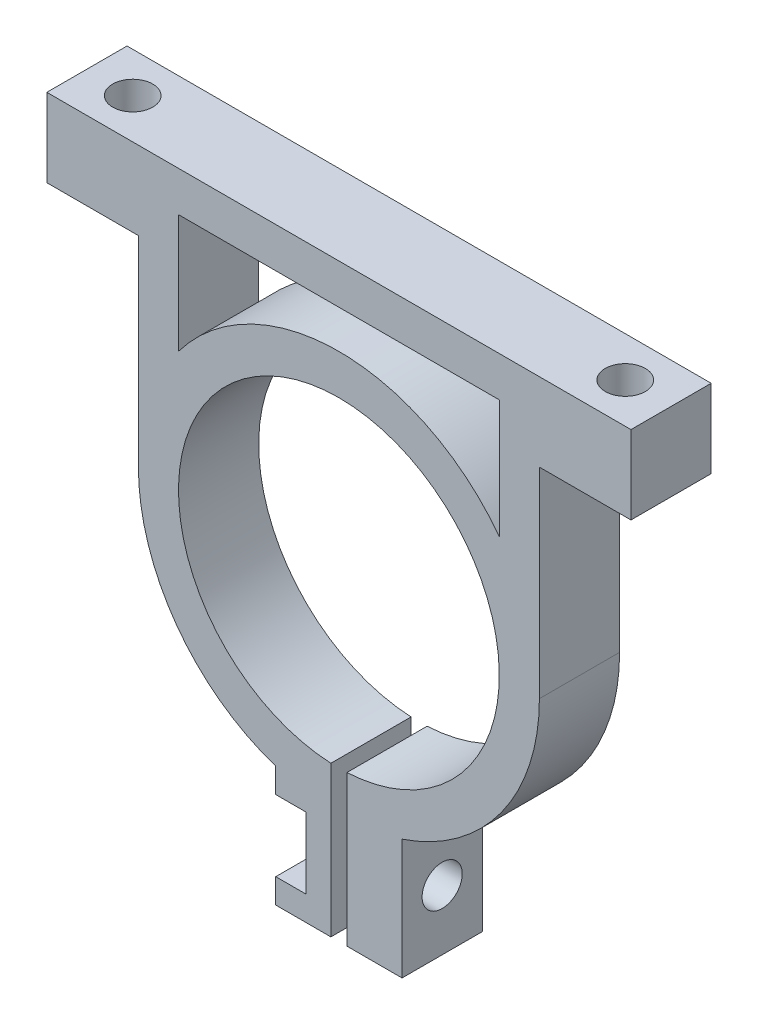
ISO-10303-21;
HEADER;
FILE_DESCRIPTION(('STEP AP214'),'2;1');
FILE_NAME('part.step','',(''),(''),'','','');
FILE_SCHEMA(('AUTOMOTIVE_DESIGN { 1 0 10303 214 1 1 1 1 }'));
ENDSEC;
DATA;
#1=APPLICATION_CONTEXT('core data for automotive mechanical design processes');
#2=APPLICATION_PROTOCOL_DEFINITION('international standard','automotive_design',2000,#1);
#3=PRODUCT_CONTEXT('',#1,'mechanical');
#4=PRODUCT('Part','Part','',(#3));
#5=PRODUCT_RELATED_PRODUCT_CATEGORY('part','',(#4));
#6=PRODUCT_DEFINITION_FORMATION('','',#4);
#7=PRODUCT_DEFINITION_CONTEXT('part definition',#1,'design');
#8=PRODUCT_DEFINITION('design','',#6,#7);
#9=PRODUCT_DEFINITION_SHAPE('','',#8);
#10=(LENGTH_UNIT() NAMED_UNIT(*) SI_UNIT(.MILLI.,.METRE.));
#11=(NAMED_UNIT(*) PLANE_ANGLE_UNIT() SI_UNIT($,.RADIAN.));
#12=(NAMED_UNIT(*) SI_UNIT($,.STERADIAN.) SOLID_ANGLE_UNIT());
#13=UNCERTAINTY_MEASURE_WITH_UNIT(LENGTH_MEASURE(1.E-05),#10,'distance_accuracy_value','');
#14=(GEOMETRIC_REPRESENTATION_CONTEXT(3) GLOBAL_UNCERTAINTY_ASSIGNED_CONTEXT((#13)) GLOBAL_UNIT_ASSIGNED_CONTEXT((#10,
#11,#12)) REPRESENTATION_CONTEXT('',''));
#15=CARTESIAN_POINT('',(0.,0.,0.));
#16=DIRECTION('',(0.,0.,1.));
#17=DIRECTION('',(1.,0.,0.));
#18=AXIS2_PLACEMENT_3D('',#15,#16,#17);
#19=CARTESIAN_POINT('',(-5.,-15.0670376982339,6.35));
#20=DIRECTION('',(1.,0.,0.));
#21=DIRECTION('',(0.,1.,0.));
#22=AXIS2_PLACEMENT_3D('',#19,#20,#21);
#23=PLANE('',#22);
#24=DIRECTION('',(0.,-1.,0.));
#25=VECTOR('',#24,1.);
#26=CARTESIAN_POINT('',(-5.,-15.0670376982339,6.35));
#27=LINE('',#26,#25);
#28=CARTESIAN_POINT('',(-5.,-22.6430376982338,6.35));
#29=VERTEX_POINT('',#28);
#30=CARTESIAN_POINT('',(-5.,-24.5920376982338,6.35));
#31=VERTEX_POINT('',#30);
#32=EDGE_CURVE('E300',#29,#31,#27,.T.);
#33=ORIENTED_EDGE('',*,*,#32,.F.);
#34=DIRECTION('',(0.,0.,-1.));
#35=VECTOR('',#34,1.);
#36=CARTESIAN_POINT('',(-5.,-22.6430376982338,6.35));
#37=LINE('',#36,#35);
#38=CARTESIAN_POINT('',(-5.,-22.6430376982338,0.));
#39=VERTEX_POINT('',#38);
#40=EDGE_CURVE('E11',#29,#39,#37,.T.);
#41=ORIENTED_EDGE('',*,*,#40,.T.);
#42=DIRECTION('',(0.,-1.,0.));
#43=VECTOR('',#42,1.);
#44=CARTESIAN_POINT('',(-5.,-15.0670376982339,0.));
#45=LINE('',#44,#43);
#46=CARTESIAN_POINT('',(-5.,-24.5920376982338,0.));
#47=VERTEX_POINT('',#46);
#48=EDGE_CURVE('E329',#39,#47,#45,.T.);
#49=ORIENTED_EDGE('',*,*,#48,.T.);
#50=DIRECTION('',(0.,0.,-1.));
#51=VECTOR('',#50,1.);
#52=CARTESIAN_POINT('',(-5.,-24.5920376982338,6.35));
#53=LINE('',#52,#51);
#54=EDGE_CURVE('E358',#31,#47,#53,.T.);
#55=ORIENTED_EDGE('',*,*,#54,.F.);
#56=EDGE_LOOP('',(#33,#41,#49,#55));
#57=FACE_BOUND('',#56,.T.);
#58=ADVANCED_FACE('F33',(#57),#23,.F.);
#59=CARTESIAN_POINT('',(-5.,-24.5920376982338,6.35));
#60=DIRECTION('',(0.,1.,0.));
#61=DIRECTION('',(0.,0.,1.));
#62=AXIS2_PLACEMENT_3D('',#59,#60,#61);
#63=PLANE('',#62);
#64=DIRECTION('',(1.,0.,0.));
#65=VECTOR('',#64,1.);
#66=CARTESIAN_POINT('',(-5.,-24.5920376982338,6.35));
#67=LINE('',#66,#65);
#68=CARTESIAN_POINT('',(0.635,-24.5920376982338,6.35));
#69=VERTEX_POINT('',#68);
#70=CARTESIAN_POINT('',(5.,-24.5920376982338,6.35));
#71=VERTEX_POINT('',#70);
#72=EDGE_CURVE('E304',#69,#71,#67,.T.);
#73=ORIENTED_EDGE('',*,*,#72,.F.);
#74=DIRECTION('',(0.,0.,-1.));
#75=VECTOR('',#74,1.);
#76=CARTESIAN_POINT('',(0.635,-24.5920376982338,6.35));
#77=LINE('',#76,#75);
#78=CARTESIAN_POINT('',(0.635,-24.5920376982338,0.));
#79=VERTEX_POINT('',#78);
#80=EDGE_CURVE('E276',#69,#79,#77,.T.);
#81=ORIENTED_EDGE('',*,*,#80,.T.);
#82=DIRECTION('',(1.,0.,0.));
#83=VECTOR('',#82,1.);
#84=CARTESIAN_POINT('',(-5.,-24.5920376982338,0.));
#85=LINE('',#84,#83);
#86=CARTESIAN_POINT('',(5.,-24.5920376982338,0.));
#87=VERTEX_POINT('',#86);
#88=EDGE_CURVE('E333',#79,#87,#85,.T.);
#89=ORIENTED_EDGE('',*,*,#88,.T.);
#90=DIRECTION('',(0.,0.,-1.));
#91=VECTOR('',#90,1.);
#92=CARTESIAN_POINT('',(5.,-24.5920376982338,6.35));
#93=LINE('',#92,#91);
#94=EDGE_CURVE('E355',#71,#87,#93,.T.);
#95=ORIENTED_EDGE('',*,*,#94,.F.);
#96=EDGE_LOOP('',(#73,#81,#89,#95));
#97=FACE_BOUND('',#96,.T.);
#98=ADVANCED_FACE('F440',(#97),#63,.F.);
#99=CARTESIAN_POINT('',(0.,0.,6.35));
#100=DIRECTION('',(0.,0.,1.));
#101=DIRECTION('',(1.,0.,0.));
#102=AXIS2_PLACEMENT_3D('',#99,#100,#101);
#103=PLANE('',#102);
#104=CARTESIAN_POINT('',(0.,0.,6.35));
#105=DIRECTION('',(0.,0.,-1.));
#106=DIRECTION('',(1.,0.,0.));
#107=AXIS2_PLACEMENT_3D('',#104,#105,#106);
#108=CIRCLE('',#107,15.875);
#109=CARTESIAN_POINT('',(-12.7,9.525,6.35));
#110=VERTEX_POINT('',#109);
#111=CARTESIAN_POINT('',(12.7,9.525,6.35));
#112=VERTEX_POINT('',#111);
#113=EDGE_CURVE('E48',#110,#112,#108,.T.);
#114=ORIENTED_EDGE('',*,*,#113,.F.);
#115=DIRECTION('',(0.,-1.,0.));
#116=VECTOR('',#115,1.);
#117=CARTESIAN_POINT('',(-12.7,18.9,6.35));
#118=LINE('',#117,#116);
#119=CARTESIAN_POINT('',(-12.7,18.9,6.35));
#120=VERTEX_POINT('',#119);
#121=EDGE_CURVE('E213',#120,#110,#118,.T.);
#122=ORIENTED_EDGE('',*,*,#121,.F.);
#123=DIRECTION('',(-1.,0.,0.));
#124=VECTOR('',#123,1.);
#125=CARTESIAN_POINT('',(12.7,18.9,6.35));
#126=LINE('',#125,#124);
#127=CARTESIAN_POINT('',(12.7,18.9,6.35));
#128=VERTEX_POINT('',#127);
#129=EDGE_CURVE('E197',#128,#120,#126,.T.);
#130=ORIENTED_EDGE('',*,*,#129,.F.);
#131=DIRECTION('',(0.,1.,0.));
#132=VECTOR('',#131,1.);
#133=CARTESIAN_POINT('',(12.7,9.525,6.35));
#134=LINE('',#133,#132);
#135=EDGE_CURVE('E206',#112,#128,#134,.T.);
#136=ORIENTED_EDGE('',*,*,#135,.F.);
#137=EDGE_LOOP('',(#114,#122,#130,#136));
#138=FACE_BOUND('',#137,.T.);
#139=DIRECTION('',(1.,0.,0.));
#140=VECTOR('',#139,1.);
#141=CARTESIAN_POINT('',(-7.4,-22.6430376982338,6.35));
#142=LINE('',#141,#140);
#143=CARTESIAN_POINT('',(-2.6,-22.6430376982338,6.35));
#144=VERTEX_POINT('',#143);
#145=EDGE_CURVE('E248',#29,#144,#142,.T.);
#146=ORIENTED_EDGE('',*,*,#145,.F.);
#147=ORIENTED_EDGE('',*,*,#32,.T.);
#148=CARTESIAN_POINT('',(-0.635,-24.5920376982338,6.35));
#149=VERTEX_POINT('',#148);
#150=EDGE_CURVE('E305',#31,#149,#67,.T.);
#151=ORIENTED_EDGE('',*,*,#150,.T.);
#152=DIRECTION('',(0.,-1.,0.));
#153=VECTOR('',#152,1.);
#154=CARTESIAN_POINT('',(-0.635,-26.10231,6.35));
#155=LINE('',#154,#153);
#156=CARTESIAN_POINT('',(-0.635,-12.6841150657032,6.35));
#157=VERTEX_POINT('',#156);
#158=EDGE_CURVE('E268',#157,#149,#155,.T.);
#159=ORIENTED_EDGE('',*,*,#158,.F.);
#160=CARTESIAN_POINT('',(0.,0.,6.35));
#161=DIRECTION('',(0.,0.,1.));
#162=DIRECTION('',(1.,0.,0.));
#163=AXIS2_PLACEMENT_3D('',#160,#161,#162);
#164=CIRCLE('',#163,12.7);
#165=CARTESIAN_POINT('',(0.635,-12.6841150657032,6.35));
#166=VERTEX_POINT('',#165);
#167=EDGE_CURVE('E280',#166,#157,#164,.T.);
#168=ORIENTED_EDGE('',*,*,#167,.F.);
#169=DIRECTION('',(0.,1.,0.));
#170=VECTOR('',#169,1.);
#171=CARTESIAN_POINT('',(0.635,-26.10231,6.35));
#172=LINE('',#171,#170);
#173=EDGE_CURVE('E263',#69,#166,#172,.T.);
#174=ORIENTED_EDGE('',*,*,#173,.F.);
#175=ORIENTED_EDGE('',*,*,#72,.T.);
#176=DIRECTION('',(0.,1.,0.));
#177=VECTOR('',#176,1.);
#178=CARTESIAN_POINT('',(5.,-15.0670376982339,6.35));
#179=LINE('',#178,#177);
#180=CARTESIAN_POINT('',(5.,-15.0670376982339,6.35));
#181=VERTEX_POINT('',#180);
#182=EDGE_CURVE('E308',#71,#181,#179,.T.);
#183=ORIENTED_EDGE('',*,*,#182,.T.);
#184=CARTESIAN_POINT('',(0.,0.,6.35));
#185=DIRECTION('',(0.,0.,1.));
#186=DIRECTION('',(1.,0.,0.));
#187=AXIS2_PLACEMENT_3D('',#184,#185,#186);
#188=CIRCLE('',#187,15.875);
#189=CARTESIAN_POINT('',(15.875,0.,6.35));
#190=VERTEX_POINT('',#189);
#191=EDGE_CURVE('E310',#181,#190,#188,.T.);
#192=ORIENTED_EDGE('',*,*,#191,.T.);
#193=DIRECTION('',(0.,1.,0.));
#194=VECTOR('',#193,1.);
#195=CARTESIAN_POINT('',(15.875,0.,6.35));
#196=LINE('',#195,#194);
#197=CARTESIAN_POINT('',(15.875,15.875,6.35));
#198=VERTEX_POINT('',#197);
#199=EDGE_CURVE('E312',#190,#198,#196,.T.);
#200=ORIENTED_EDGE('',*,*,#199,.T.);
#201=DIRECTION('',(1.,0.,0.));
#202=VECTOR('',#201,1.);
#203=CARTESIAN_POINT('',(15.875,15.875,6.35));
#204=LINE('',#203,#202);
#205=CARTESIAN_POINT('',(23.124999989,15.875,6.35));
#206=VERTEX_POINT('',#205);
#207=EDGE_CURVE('E314',#198,#206,#204,.T.);
#208=ORIENTED_EDGE('',*,*,#207,.T.);
#209=DIRECTION('',(0.,1.,0.));
#210=VECTOR('',#209,1.);
#211=CARTESIAN_POINT('',(23.124999989,15.875,6.35));
#212=LINE('',#211,#210);
#213=CARTESIAN_POINT('',(23.124999989,22.075,6.35));
#214=VERTEX_POINT('',#213);
#215=EDGE_CURVE('E286',#206,#214,#212,.T.);
#216=ORIENTED_EDGE('',*,*,#215,.T.);
#217=DIRECTION('',(-1.,0.,0.));
#218=VECTOR('',#217,1.);
#219=CARTESIAN_POINT('',(-23.124999989,22.075,6.35));
#220=LINE('',#219,#218);
#221=CARTESIAN_POINT('',(-23.124999989,22.075,6.35));
#222=VERTEX_POINT('',#221);
#223=EDGE_CURVE('E289',#214,#222,#220,.T.);
#224=ORIENTED_EDGE('',*,*,#223,.T.);
#225=DIRECTION('',(0.,-1.,0.));
#226=VECTOR('',#225,1.);
#227=CARTESIAN_POINT('',(-23.124999989,15.875,6.35));
#228=LINE('',#227,#226);
#229=CARTESIAN_POINT('',(-23.124999989,15.875,6.35));
#230=VERTEX_POINT('',#229);
#231=EDGE_CURVE('E292',#222,#230,#228,.T.);
#232=ORIENTED_EDGE('',*,*,#231,.T.);
#233=DIRECTION('',(1.,0.,0.));
#234=VECTOR('',#233,1.);
#235=CARTESIAN_POINT('',(-23.124999989,15.875,6.35));
#236=LINE('',#235,#234);
#237=CARTESIAN_POINT('',(-15.875,15.875,6.35));
#238=VERTEX_POINT('',#237);
#239=EDGE_CURVE('E294',#230,#238,#236,.T.);
#240=ORIENTED_EDGE('',*,*,#239,.T.);
#241=DIRECTION('',(0.,-1.,0.));
#242=VECTOR('',#241,1.);
#243=CARTESIAN_POINT('',(-15.875,0.,6.35));
#244=LINE('',#243,#242);
#245=CARTESIAN_POINT('',(-15.875,0.,6.35));
#246=VERTEX_POINT('',#245);
#247=EDGE_CURVE('E296',#238,#246,#244,.T.);
#248=ORIENTED_EDGE('',*,*,#247,.T.);
#249=CARTESIAN_POINT('',(0.,0.,6.35));
#250=DIRECTION('',(0.,0.,1.));
#251=DIRECTION('',(1.,0.,0.));
#252=AXIS2_PLACEMENT_3D('',#249,#250,#251);
#253=CIRCLE('',#252,15.875);
#254=CARTESIAN_POINT('',(-5.,-15.0670376982338,6.35));
#255=VERTEX_POINT('',#254);
#256=EDGE_CURVE('E298',#246,#255,#253,.T.);
#257=ORIENTED_EDGE('',*,*,#256,.T.);
#258=CARTESIAN_POINT('',(-5.,-17.0160376982338,6.35));
#259=VERTEX_POINT('',#258);
#260=EDGE_CURVE('E301',#255,#259,#27,.T.);
#261=ORIENTED_EDGE('',*,*,#260,.T.);
#262=DIRECTION('',(-1.,0.,0.));
#263=VECTOR('',#262,1.);
#264=CARTESIAN_POINT('',(-7.4,-17.0160376982338,6.35));
#265=LINE('',#264,#263);
#266=CARTESIAN_POINT('',(-2.6,-17.0160376982338,6.35));
#267=VERTEX_POINT('',#266);
#268=EDGE_CURVE('E246',#267,#259,#265,.T.);
#269=ORIENTED_EDGE('',*,*,#268,.F.);
#270=DIRECTION('',(0.,1.,0.));
#271=VECTOR('',#270,1.);
#272=CARTESIAN_POINT('',(-2.6,-22.6430376982338,6.35));
#273=LINE('',#272,#271);
#274=EDGE_CURVE('E237',#144,#267,#273,.T.);
#275=ORIENTED_EDGE('',*,*,#274,.F.);
#276=EDGE_LOOP('',(#146,#147,#151,#159,#168,#174,#175,#183,#192,#200,#208,#216,#224,#232,#240,
#248,#257,#261,#269,#275));
#277=FACE_BOUND('',#276,.T.);
#278=ADVANCED_FACE('F210',(#138,#277),#103,.T.);
#279=CARTESIAN_POINT('',(0.,0.,0.));
#280=DIRECTION('',(0.,0.,1.));
#281=DIRECTION('',(1.,0.,0.));
#282=AXIS2_PLACEMENT_3D('',#279,#280,#281);
#283=PLANE('',#282);
#284=DIRECTION('',(0.,1.,0.));
#285=VECTOR('',#284,1.);
#286=CARTESIAN_POINT('',(-12.7,18.9,0.));
#287=LINE('',#286,#285);
#288=CARTESIAN_POINT('',(-12.7,9.525,0.));
#289=VERTEX_POINT('',#288);
#290=CARTESIAN_POINT('',(-12.7,18.9,0.));
#291=VERTEX_POINT('',#290);
#292=EDGE_CURVE('E558',#289,#291,#287,.T.);
#293=ORIENTED_EDGE('',*,*,#292,.F.);
#294=CARTESIAN_POINT('',(0.,0.,0.));
#295=DIRECTION('',(0.,0.,1.));
#296=DIRECTION('',(1.,0.,0.));
#297=AXIS2_PLACEMENT_3D('',#294,#295,#296);
#298=CIRCLE('',#297,15.875);
#299=CARTESIAN_POINT('',(12.7,9.525,0.));
#300=VERTEX_POINT('',#299);
#301=EDGE_CURVE('E225',#300,#289,#298,.T.);
#302=ORIENTED_EDGE('',*,*,#301,.F.);
#303=DIRECTION('',(0.,-1.,0.));
#304=VECTOR('',#303,1.);
#305=CARTESIAN_POINT('',(12.7,9.525,0.));
#306=LINE('',#305,#304);
#307=CARTESIAN_POINT('',(12.7,18.9,0.));
#308=VERTEX_POINT('',#307);
#309=EDGE_CURVE('E222',#308,#300,#306,.T.);
#310=ORIENTED_EDGE('',*,*,#309,.F.);
#311=DIRECTION('',(1.,0.,0.));
#312=VECTOR('',#311,1.);
#313=CARTESIAN_POINT('',(12.7,18.9,0.));
#314=LINE('',#313,#312);
#315=EDGE_CURVE('E200',#291,#308,#314,.T.);
#316=ORIENTED_EDGE('',*,*,#315,.F.);
#317=EDGE_LOOP('',(#293,#302,#310,#316));
#318=FACE_BOUND('',#317,.T.);
#319=ORIENTED_EDGE('',*,*,#48,.F.);
#320=DIRECTION('',(-1.,0.,0.));
#321=VECTOR('',#320,1.);
#322=CARTESIAN_POINT('',(-7.4,-22.6430376982338,0.));
#323=LINE('',#322,#321);
#324=CARTESIAN_POINT('',(-2.6,-22.6430376982338,0.));
#325=VERTEX_POINT('',#324);
#326=EDGE_CURVE('E238',#325,#39,#323,.T.);
#327=ORIENTED_EDGE('',*,*,#326,.F.);
#328=DIRECTION('',(0.,-1.,0.));
#329=VECTOR('',#328,1.);
#330=CARTESIAN_POINT('',(-2.6,-22.6430376982338,0.));
#331=LINE('',#330,#329);
#332=CARTESIAN_POINT('',(-2.6,-17.0160376982338,0.));
#333=VERTEX_POINT('',#332);
#334=EDGE_CURVE('E240',#333,#325,#331,.T.);
#335=ORIENTED_EDGE('',*,*,#334,.F.);
#336=DIRECTION('',(1.,0.,0.));
#337=VECTOR('',#336,1.);
#338=CARTESIAN_POINT('',(-7.4,-17.0160376982338,0.));
#339=LINE('',#338,#337);
#340=CARTESIAN_POINT('',(-5.,-17.0160376982338,0.));
#341=VERTEX_POINT('',#340);
#342=EDGE_CURVE('E243',#341,#333,#339,.T.);
#343=ORIENTED_EDGE('',*,*,#342,.F.);
#344=CARTESIAN_POINT('',(-5.,-15.0670376982338,0.));
#345=VERTEX_POINT('',#344);
#346=EDGE_CURVE('E330',#345,#341,#45,.T.);
#347=ORIENTED_EDGE('',*,*,#346,.F.);
#348=CARTESIAN_POINT('',(0.,0.,0.));
#349=DIRECTION('',(0.,0.,1.));
#350=DIRECTION('',(1.,0.,0.));
#351=AXIS2_PLACEMENT_3D('',#348,#349,#350);
#352=CIRCLE('',#351,15.875);
#353=CARTESIAN_POINT('',(-15.875,0.,0.));
#354=VERTEX_POINT('',#353);
#355=EDGE_CURVE('E327',#354,#345,#352,.T.);
#356=ORIENTED_EDGE('',*,*,#355,.F.);
#357=DIRECTION('',(0.,-1.,0.));
#358=VECTOR('',#357,1.);
#359=CARTESIAN_POINT('',(-15.875,0.,0.));
#360=LINE('',#359,#358);
#361=CARTESIAN_POINT('',(-15.875,15.875,0.));
#362=VERTEX_POINT('',#361);
#363=EDGE_CURVE('E325',#362,#354,#360,.T.);
#364=ORIENTED_EDGE('',*,*,#363,.F.);
#365=DIRECTION('',(1.,0.,0.));
#366=VECTOR('',#365,1.);
#367=CARTESIAN_POINT('',(-23.124999989,15.875,0.));
#368=LINE('',#367,#366);
#369=CARTESIAN_POINT('',(-23.124999989,15.875,0.));
#370=VERTEX_POINT('',#369);
#371=EDGE_CURVE('E323',#370,#362,#368,.T.);
#372=ORIENTED_EDGE('',*,*,#371,.F.);
#373=DIRECTION('',(0.,-1.,0.));
#374=VECTOR('',#373,1.);
#375=CARTESIAN_POINT('',(-23.124999989,15.875,0.));
#376=LINE('',#375,#374);
#377=CARTESIAN_POINT('',(-23.124999989,22.075,0.));
#378=VERTEX_POINT('',#377);
#379=EDGE_CURVE('E321',#378,#370,#376,.T.);
#380=ORIENTED_EDGE('',*,*,#379,.F.);
#381=DIRECTION('',(-1.,0.,0.));
#382=VECTOR('',#381,1.);
#383=CARTESIAN_POINT('',(-23.124999989,22.075,0.));
#384=LINE('',#383,#382);
#385=CARTESIAN_POINT('',(23.124999989,22.075,0.));
#386=VERTEX_POINT('',#385);
#387=EDGE_CURVE('E319',#386,#378,#384,.T.);
#388=ORIENTED_EDGE('',*,*,#387,.F.);
#389=DIRECTION('',(0.,1.,0.));
#390=VECTOR('',#389,1.);
#391=CARTESIAN_POINT('',(23.124999989,15.875,0.));
#392=LINE('',#391,#390);
#393=CARTESIAN_POINT('',(23.124999989,15.875,0.));
#394=VERTEX_POINT('',#393);
#395=EDGE_CURVE('E283',#394,#386,#392,.T.);
#396=ORIENTED_EDGE('',*,*,#395,.F.);
#397=DIRECTION('',(1.,0.,0.));
#398=VECTOR('',#397,1.);
#399=CARTESIAN_POINT('',(15.875,15.875,0.));
#400=LINE('',#399,#398);
#401=CARTESIAN_POINT('',(15.875,15.875,0.));
#402=VERTEX_POINT('',#401);
#403=EDGE_CURVE('E290',#402,#394,#400,.T.);
#404=ORIENTED_EDGE('',*,*,#403,.F.);
#405=DIRECTION('',(0.,1.,0.));
#406=VECTOR('',#405,1.);
#407=CARTESIAN_POINT('',(15.875,0.,0.));
#408=LINE('',#407,#406);
#409=CARTESIAN_POINT('',(15.875,0.,0.));
#410=VERTEX_POINT('',#409);
#411=EDGE_CURVE('E341',#410,#402,#408,.T.);
#412=ORIENTED_EDGE('',*,*,#411,.F.);
#413=CARTESIAN_POINT('',(0.,0.,0.));
#414=DIRECTION('',(0.,0.,1.));
#415=DIRECTION('',(1.,0.,0.));
#416=AXIS2_PLACEMENT_3D('',#413,#414,#415);
#417=CIRCLE('',#416,15.875);
#418=CARTESIAN_POINT('',(5.,-15.0670376982339,0.));
#419=VERTEX_POINT('',#418);
#420=EDGE_CURVE('E339',#419,#410,#417,.T.);
#421=ORIENTED_EDGE('',*,*,#420,.F.);
#422=DIRECTION('',(0.,1.,0.));
#423=VECTOR('',#422,1.);
#424=CARTESIAN_POINT('',(5.,-15.0670376982339,0.));
#425=LINE('',#424,#423);
#426=EDGE_CURVE('E337',#87,#419,#425,.T.);
#427=ORIENTED_EDGE('',*,*,#426,.F.);
#428=ORIENTED_EDGE('',*,*,#88,.F.);
#429=DIRECTION('',(0.,1.,0.));
#430=VECTOR('',#429,1.);
#431=CARTESIAN_POINT('',(0.635,-26.10231,0.));
#432=LINE('',#431,#430);
#433=CARTESIAN_POINT('',(0.635,-12.6841150657032,0.));
#434=VERTEX_POINT('',#433);
#435=EDGE_CURVE('E264',#79,#434,#432,.T.);
#436=ORIENTED_EDGE('',*,*,#435,.T.);
#437=CARTESIAN_POINT('',(0.,0.,0.));
#438=DIRECTION('',(0.,0.,1.));
#439=DIRECTION('',(1.,0.,0.));
#440=AXIS2_PLACEMENT_3D('',#437,#438,#439);
#441=CIRCLE('',#440,12.7);
#442=CARTESIAN_POINT('',(-0.635,-12.6841150657032,0.));
#443=VERTEX_POINT('',#442);
#444=EDGE_CURVE('E279',#434,#443,#441,.T.);
#445=ORIENTED_EDGE('',*,*,#444,.T.);
#446=DIRECTION('',(0.,-1.,0.));
#447=VECTOR('',#446,1.);
#448=CARTESIAN_POINT('',(-0.635,-26.10231,0.));
#449=LINE('',#448,#447);
#450=CARTESIAN_POINT('',(-0.635,-24.5920376982338,0.));
#451=VERTEX_POINT('',#450);
#452=EDGE_CURVE('E267',#443,#451,#449,.T.);
#453=ORIENTED_EDGE('',*,*,#452,.T.);
#454=EDGE_CURVE('E334',#47,#451,#85,.T.);
#455=ORIENTED_EDGE('',*,*,#454,.F.);
#456=EDGE_LOOP('',(#319,#327,#335,#343,#347,#356,#364,#372,#380,#388,#396,#404,#412,#421,#427,
#428,#436,#445,#453,#455));
#457=FACE_BOUND('',#456,.T.);
#458=ADVANCED_FACE('F405',(#318,#457),#283,.F.);
#459=CARTESIAN_POINT('',(23.124999989,15.875,6.35));
#460=DIRECTION('',(-1.,0.,0.));
#461=DIRECTION('',(0.,0.,1.));
#462=AXIS2_PLACEMENT_3D('',#459,#460,#461);
#463=PLANE('',#462);
#464=ORIENTED_EDGE('',*,*,#395,.T.);
#465=DIRECTION('',(0.,0.,-1.));
#466=VECTOR('',#465,1.);
#467=CARTESIAN_POINT('',(23.124999989,22.075,6.35));
#468=LINE('',#467,#466);
#469=EDGE_CURVE('E376',#214,#386,#468,.T.);
#470=ORIENTED_EDGE('',*,*,#469,.F.);
#471=ORIENTED_EDGE('',*,*,#215,.F.);
#472=DIRECTION('',(0.,0.,-1.));
#473=VECTOR('',#472,1.);
#474=CARTESIAN_POINT('',(23.124999989,15.875,6.35));
#475=LINE('',#474,#473);
#476=EDGE_CURVE('E316',#206,#394,#475,.T.);
#477=ORIENTED_EDGE('',*,*,#476,.T.);
#478=EDGE_LOOP('',(#464,#470,#471,#477));
#479=FACE_BOUND('',#478,.T.);
#480=ADVANCED_FACE('F35',(#479),#463,.F.);
#481=CARTESIAN_POINT('',(-23.124999989,22.075,6.35));
#482=DIRECTION('',(0.,-1.,0.));
#483=DIRECTION('',(0.,0.,-1.));
#484=AXIS2_PLACEMENT_3D('',#481,#482,#483);
#485=PLANE('',#484);
#486=CARTESIAN_POINT('',(-19.4999999945,22.075,3.175));
#487=DIRECTION('',(0.,-1.,0.));
#488=DIRECTION('',(0.,0.,-1.));
#489=AXIS2_PLACEMENT_3D('',#486,#487,#488);
#490=CIRCLE('',#489,1.5875);
#491=CARTESIAN_POINT('',(-19.4999999945,22.075,1.5875));
#492=VERTEX_POINT('',#491);
#493=EDGE_CURVE('E228',#492,#492,#490,.F.);
#494=ORIENTED_EDGE('',*,*,#493,.F.);
#495=EDGE_LOOP('',(#494));
#496=FACE_BOUND('',#495,.T.);
#497=CARTESIAN_POINT('',(19.4999999945,22.075,3.175));
#498=DIRECTION('',(0.,-1.,0.));
#499=DIRECTION('',(0.,0.,-1.));
#500=AXIS2_PLACEMENT_3D('',#497,#498,#499);
#501=CIRCLE('',#500,1.5875);
#502=CARTESIAN_POINT('',(19.4999999945,22.075,1.5875));
#503=VERTEX_POINT('',#502);
#504=EDGE_CURVE('E234',#503,#503,#501,.F.);
#505=ORIENTED_EDGE('',*,*,#504,.F.);
#506=EDGE_LOOP('',(#505));
#507=FACE_BOUND('',#506,.T.);
#508=ORIENTED_EDGE('',*,*,#387,.T.);
#509=DIRECTION('',(0.,0.,-1.));
#510=VECTOR('',#509,1.);
#511=CARTESIAN_POINT('',(-23.124999989,22.075,6.35));
#512=LINE('',#511,#510);
#513=EDGE_CURVE('E373',#222,#378,#512,.T.);
#514=ORIENTED_EDGE('',*,*,#513,.F.);
#515=ORIENTED_EDGE('',*,*,#223,.F.);
#516=ORIENTED_EDGE('',*,*,#469,.T.);
#517=EDGE_LOOP('',(#508,#514,#515,#516));
#518=FACE_BOUND('',#517,.T.);
#519=ADVANCED_FACE('F465',(#496,#507,#518),#485,.F.);
#520=CARTESIAN_POINT('',(-23.124999989,15.875,6.35));
#521=DIRECTION('',(1.,0.,0.));
#522=DIRECTION('',(0.,0.,-1.));
#523=AXIS2_PLACEMENT_3D('',#520,#521,#522);
#524=PLANE('',#523);
#525=ORIENTED_EDGE('',*,*,#379,.T.);
#526=DIRECTION('',(0.,0.,-1.));
#527=VECTOR('',#526,1.);
#528=CARTESIAN_POINT('',(-23.124999989,15.875,6.35));
#529=LINE('',#528,#527);
#530=EDGE_CURVE('E370',#230,#370,#529,.T.);
#531=ORIENTED_EDGE('',*,*,#530,.F.);
#532=ORIENTED_EDGE('',*,*,#231,.F.);
#533=ORIENTED_EDGE('',*,*,#513,.T.);
#534=EDGE_LOOP('',(#525,#531,#532,#533));
#535=FACE_BOUND('',#534,.T.);
#536=ADVANCED_FACE('F470',(#535),#524,.F.);
#537=CARTESIAN_POINT('',(-23.124999989,15.875,6.35));
#538=DIRECTION('',(0.,1.,0.));
#539=DIRECTION('',(0.,0.,1.));
#540=AXIS2_PLACEMENT_3D('',#537,#538,#539);
#541=PLANE('',#540);
#542=CARTESIAN_POINT('',(-19.4999999945,15.875,3.175));
#543=DIRECTION('',(0.,-1.,0.));
#544=DIRECTION('',(1.,0.,0.));
#545=AXIS2_PLACEMENT_3D('',#542,#543,#544);
#546=CIRCLE('',#545,1.5875);
#547=CARTESIAN_POINT('',(-17.9124999945,15.875,3.175));
#548=VERTEX_POINT('',#547);
#549=EDGE_CURVE('E224',#548,#548,#546,.T.);
#550=ORIENTED_EDGE('',*,*,#549,.F.);
#551=EDGE_LOOP('',(#550));
#552=FACE_BOUND('',#551,.T.);
#553=ORIENTED_EDGE('',*,*,#371,.T.);
#554=DIRECTION('',(0.,0.,-1.));
#555=VECTOR('',#554,1.);
#556=CARTESIAN_POINT('',(-15.875,15.875,6.35));
#557=LINE('',#556,#555);
#558=EDGE_CURVE('E367',#238,#362,#557,.T.);
#559=ORIENTED_EDGE('',*,*,#558,.F.);
#560=ORIENTED_EDGE('',*,*,#239,.F.);
#561=ORIENTED_EDGE('',*,*,#530,.T.);
#562=EDGE_LOOP('',(#553,#559,#560,#561));
#563=FACE_BOUND('',#562,.T.);
#564=ADVANCED_FACE('F474',(#552,#563),#541,.F.);
#565=CARTESIAN_POINT('',(-15.875,0.,6.35));
#566=DIRECTION('',(1.,0.,0.));
#567=DIRECTION('',(0.,0.,-1.));
#568=AXIS2_PLACEMENT_3D('',#565,#566,#567);
#569=PLANE('',#568);
#570=ORIENTED_EDGE('',*,*,#363,.T.);
#571=DIRECTION('',(0.,0.,-1.));
#572=VECTOR('',#571,1.);
#573=CARTESIAN_POINT('',(-15.875,0.,6.35));
#574=LINE('',#573,#572);
#575=EDGE_CURVE('E364',#246,#354,#574,.T.);
#576=ORIENTED_EDGE('',*,*,#575,.F.);
#577=ORIENTED_EDGE('',*,*,#247,.F.);
#578=ORIENTED_EDGE('',*,*,#558,.T.);
#579=EDGE_LOOP('',(#570,#576,#577,#578));
#580=FACE_BOUND('',#579,.T.);
#581=ADVANCED_FACE('F477',(#580),#569,.F.);
#582=CARTESIAN_POINT('',(0.,0.,6.35));
#583=DIRECTION('',(0.,0.,-1.));
#584=DIRECTION('',(-1.,0.,0.));
#585=AXIS2_PLACEMENT_3D('',#582,#583,#584);
#586=CYLINDRICAL_SURFACE('',#585,15.875);
#587=ORIENTED_EDGE('',*,*,#355,.T.);
#588=DIRECTION('',(0.,0.,-1.));
#589=VECTOR('',#588,1.);
#590=CARTESIAN_POINT('',(-5.,-15.0670376982338,6.35));
#591=LINE('',#590,#589);
#592=EDGE_CURVE('E361',#255,#345,#591,.T.);
#593=ORIENTED_EDGE('',*,*,#592,.F.);
#594=ORIENTED_EDGE('',*,*,#256,.F.);
#595=ORIENTED_EDGE('',*,*,#575,.T.);
#596=EDGE_LOOP('',(#587,#593,#594,#595));
#597=FACE_BOUND('',#596,.T.);
#598=ADVANCED_FACE('F401',(#597),#586,.T.);
#599=ORIENTED_EDGE('',*,*,#346,.T.);
#600=DIRECTION('',(0.,0.,1.));
#601=VECTOR('',#600,1.);
#602=CARTESIAN_POINT('',(-5.,-17.0160376982338,6.35));
#603=LINE('',#602,#601);
#604=EDGE_CURVE('E41',#341,#259,#603,.T.);
#605=ORIENTED_EDGE('',*,*,#604,.T.);
#606=ORIENTED_EDGE('',*,*,#260,.F.);
#607=ORIENTED_EDGE('',*,*,#592,.T.);
#608=EDGE_LOOP('',(#599,#605,#606,#607));
#609=FACE_BOUND('',#608,.T.);
#610=ADVANCED_FACE('F389',(#609),#23,.F.);
#611=ORIENTED_EDGE('',*,*,#454,.T.);
#612=DIRECTION('',(0.,0.,1.));
#613=VECTOR('',#612,1.);
#614=CARTESIAN_POINT('',(-0.635,-24.5920376982338,6.35));
#615=LINE('',#614,#613);
#616=EDGE_CURVE('E271',#451,#149,#615,.T.);
#617=ORIENTED_EDGE('',*,*,#616,.T.);
#618=ORIENTED_EDGE('',*,*,#150,.F.);
#619=ORIENTED_EDGE('',*,*,#54,.T.);
#620=EDGE_LOOP('',(#611,#617,#618,#619));
#621=FACE_BOUND('',#620,.T.);
#622=ADVANCED_FACE('F422',(#621),#63,.F.);
#623=CARTESIAN_POINT('',(5.,-15.0670376982339,6.35));
#624=DIRECTION('',(-1.,0.,0.));
#625=DIRECTION('',(0.,-1.,0.));
#626=AXIS2_PLACEMENT_3D('',#623,#624,#625);
#627=PLANE('',#626);
#628=CARTESIAN_POINT('',(5.,-19.8295376982338,3.175));
#629=DIRECTION('',(1.,0.,0.));
#630=DIRECTION('',(0.,1.,0.));
#631=AXIS2_PLACEMENT_3D('',#628,#629,#630);
#632=CIRCLE('',#631,1.5875);
#633=CARTESIAN_POINT('',(5.,-18.2420376982339,3.175));
#634=VERTEX_POINT('',#633);
#635=EDGE_CURVE('E256',#634,#634,#632,.T.);
#636=ORIENTED_EDGE('',*,*,#635,.F.);
#637=EDGE_LOOP('',(#636));
#638=FACE_BOUND('',#637,.T.);
#639=ORIENTED_EDGE('',*,*,#426,.T.);
#640=DIRECTION('',(0.,0.,-1.));
#641=VECTOR('',#640,1.);
#642=CARTESIAN_POINT('',(5.,-15.0670376982339,6.35));
#643=LINE('',#642,#641);
#644=EDGE_CURVE('E352',#181,#419,#643,.T.);
#645=ORIENTED_EDGE('',*,*,#644,.F.);
#646=ORIENTED_EDGE('',*,*,#182,.F.);
#647=ORIENTED_EDGE('',*,*,#94,.T.);
#648=EDGE_LOOP('',(#639,#645,#646,#647));
#649=FACE_BOUND('',#648,.T.);
#650=ADVANCED_FACE('F443',(#638,#649),#627,.F.);
#651=CARTESIAN_POINT('',(0.,0.,6.35));
#652=DIRECTION('',(0.,0.,-1.));
#653=DIRECTION('',(-1.,0.,0.));
#654=AXIS2_PLACEMENT_3D('',#651,#652,#653);
#655=CYLINDRICAL_SURFACE('',#654,15.875);
#656=ORIENTED_EDGE('',*,*,#420,.T.);
#657=DIRECTION('',(0.,0.,-1.));
#658=VECTOR('',#657,1.);
#659=CARTESIAN_POINT('',(15.875,0.,6.35));
#660=LINE('',#659,#658);
#661=EDGE_CURVE('E349',#190,#410,#660,.T.);
#662=ORIENTED_EDGE('',*,*,#661,.F.);
#663=ORIENTED_EDGE('',*,*,#191,.F.);
#664=ORIENTED_EDGE('',*,*,#644,.T.);
#665=EDGE_LOOP('',(#656,#662,#663,#664));
#666=FACE_BOUND('',#665,.T.);
#667=ADVANCED_FACE('F450',(#666),#655,.T.);
#668=CARTESIAN_POINT('',(15.875,0.,6.35));
#669=DIRECTION('',(-1.,0.,0.));
#670=DIRECTION('',(0.,0.,1.));
#671=AXIS2_PLACEMENT_3D('',#668,#669,#670);
#672=PLANE('',#671);
#673=ORIENTED_EDGE('',*,*,#411,.T.);
#674=DIRECTION('',(0.,0.,-1.));
#675=VECTOR('',#674,1.);
#676=CARTESIAN_POINT('',(15.875,15.875,6.35));
#677=LINE('',#676,#675);
#678=EDGE_CURVE('E346',#198,#402,#677,.T.);
#679=ORIENTED_EDGE('',*,*,#678,.F.);
#680=ORIENTED_EDGE('',*,*,#199,.F.);
#681=ORIENTED_EDGE('',*,*,#661,.T.);
#682=EDGE_LOOP('',(#673,#679,#680,#681));
#683=FACE_BOUND('',#682,.T.);
#684=ADVANCED_FACE('F453',(#683),#672,.F.);
#685=CARTESIAN_POINT('',(15.875,15.875,6.35));
#686=DIRECTION('',(0.,1.,0.));
#687=DIRECTION('',(0.,0.,1.));
#688=AXIS2_PLACEMENT_3D('',#685,#686,#687);
#689=PLANE('',#688);
#690=CARTESIAN_POINT('',(19.4999999945,15.875,3.175));
#691=DIRECTION('',(0.,-1.,0.));
#692=DIRECTION('',(1.,0.,0.));
#693=AXIS2_PLACEMENT_3D('',#690,#691,#692);
#694=CIRCLE('',#693,1.5875);
#695=CARTESIAN_POINT('',(21.0874999945,15.875,3.175));
#696=VERTEX_POINT('',#695);
#697=EDGE_CURVE('E231',#696,#696,#694,.T.);
#698=ORIENTED_EDGE('',*,*,#697,.F.);
#699=EDGE_LOOP('',(#698));
#700=FACE_BOUND('',#699,.T.);
#701=ORIENTED_EDGE('',*,*,#403,.T.);
#702=ORIENTED_EDGE('',*,*,#476,.F.);
#703=ORIENTED_EDGE('',*,*,#207,.F.);
#704=ORIENTED_EDGE('',*,*,#678,.T.);
#705=EDGE_LOOP('',(#701,#702,#703,#704));
#706=FACE_BOUND('',#705,.T.);
#707=ADVANCED_FACE('F458',(#700,#706),#689,.F.);
#708=CARTESIAN_POINT('',(0.,0.,6.35));
#709=DIRECTION('',(0.,0.,-1.));
#710=DIRECTION('',(-1.,0.,0.));
#711=AXIS2_PLACEMENT_3D('',#708,#709,#710);
#712=CYLINDRICAL_SURFACE('',#711,12.7);
#713=DIRECTION('',(0.,0.,-1.));
#714=VECTOR('',#713,1.);
#715=CARTESIAN_POINT('',(0.635,-12.6841150657032,6.35));
#716=LINE('',#715,#714);
#717=EDGE_CURVE('E381',#166,#434,#716,.T.);
#718=ORIENTED_EDGE('',*,*,#717,.F.);
#719=ORIENTED_EDGE('',*,*,#167,.T.);
#720=DIRECTION('',(0.,0.,-1.));
#721=VECTOR('',#720,1.);
#722=CARTESIAN_POINT('',(-0.635,-12.6841150657032,6.35));
#723=LINE('',#722,#721);
#724=EDGE_CURVE('E379',#443,#157,#723,.F.);
#725=ORIENTED_EDGE('',*,*,#724,.F.);
#726=ORIENTED_EDGE('',*,*,#444,.F.);
#727=EDGE_LOOP('',(#718,#719,#725,#726));
#728=FACE_BOUND('',#727,.T.);
#729=ADVANCED_FACE('F430',(#728),#712,.F.);
#730=CARTESIAN_POINT('',(-0.635,-26.10231,0.));
#731=DIRECTION('',(-1.,0.,0.));
#732=DIRECTION('',(0.,0.,1.));
#733=AXIS2_PLACEMENT_3D('',#730,#731,#732);
#734=PLANE('',#733);
#735=CARTESIAN_POINT('',(-0.635,-19.8295376982338,3.175));
#736=DIRECTION('',(-1.,0.,0.));
#737=DIRECTION('',(0.,0.,1.));
#738=AXIS2_PLACEMENT_3D('',#735,#736,#737);
#739=CIRCLE('',#738,1.5875);
#740=CARTESIAN_POINT('',(-0.635,-19.8295376982338,4.7625));
#741=VERTEX_POINT('',#740);
#742=EDGE_CURVE('E260',#741,#741,#739,.T.);
#743=ORIENTED_EDGE('',*,*,#742,.T.);
#744=EDGE_LOOP('',(#743));
#745=FACE_BOUND('',#744,.T.);
#746=ORIENTED_EDGE('',*,*,#452,.F.);
#747=ORIENTED_EDGE('',*,*,#724,.T.);
#748=ORIENTED_EDGE('',*,*,#158,.T.);
#749=ORIENTED_EDGE('',*,*,#616,.F.);
#750=EDGE_LOOP('',(#746,#747,#748,#749));
#751=FACE_BOUND('',#750,.T.);
#752=ADVANCED_FACE('F517',(#745,#751),#734,.F.);
#753=CARTESIAN_POINT('',(0.635,-26.10231,0.));
#754=DIRECTION('',(1.,0.,0.));
#755=DIRECTION('',(0.,0.,-1.));
#756=AXIS2_PLACEMENT_3D('',#753,#754,#755);
#757=PLANE('',#756);
#758=CARTESIAN_POINT('',(0.635,-19.8295376982338,3.175));
#759=DIRECTION('',(1.,0.,0.));
#760=DIRECTION('',(0.,0.,-1.));
#761=AXIS2_PLACEMENT_3D('',#758,#759,#760);
#762=CIRCLE('',#761,1.5875);
#763=CARTESIAN_POINT('',(0.635,-19.8295376982338,1.5875));
#764=VERTEX_POINT('',#763);
#765=EDGE_CURVE('E259',#764,#764,#762,.T.);
#766=ORIENTED_EDGE('',*,*,#765,.T.);
#767=EDGE_LOOP('',(#766));
#768=FACE_BOUND('',#767,.T.);
#769=ORIENTED_EDGE('',*,*,#173,.T.);
#770=ORIENTED_EDGE('',*,*,#717,.T.);
#771=ORIENTED_EDGE('',*,*,#435,.F.);
#772=ORIENTED_EDGE('',*,*,#80,.F.);
#773=EDGE_LOOP('',(#769,#770,#771,#772));
#774=FACE_BOUND('',#773,.T.);
#775=ADVANCED_FACE('F433',(#768,#774),#757,.F.);
#776=CARTESIAN_POINT('',(-9.49012806053458,-19.8295376982338,3.175));
#777=DIRECTION('',(1.,0.,0.));
#778=DIRECTION('',(0.,1.,0.));
#779=AXIS2_PLACEMENT_3D('',#776,#777,#778);
#780=CYLINDRICAL_SURFACE('',#779,1.5875);
#781=ORIENTED_EDGE('',*,*,#635,.T.);
#782=EDGE_LOOP('',(#781));
#783=FACE_BOUND('',#782,.T.);
#784=ORIENTED_EDGE('',*,*,#765,.F.);
#785=EDGE_LOOP('',(#784));
#786=FACE_BOUND('',#785,.T.);
#787=ADVANCED_FACE('F520',(#783,#786),#780,.F.);
#788=CARTESIAN_POINT('',(-2.6,-19.8295376982338,3.175));
#789=DIRECTION('',(1.,0.,0.));
#790=DIRECTION('',(0.,0.,-1.));
#791=AXIS2_PLACEMENT_3D('',#788,#789,#790);
#792=CIRCLE('',#791,1.5875);
#793=CARTESIAN_POINT('',(-2.6,-19.8295376982338,1.5875));
#794=VERTEX_POINT('',#793);
#795=EDGE_CURVE('E255',#794,#794,#792,.F.);
#796=ORIENTED_EDGE('',*,*,#795,.T.);
#797=EDGE_LOOP('',(#796));
#798=FACE_BOUND('',#797,.T.);
#799=ORIENTED_EDGE('',*,*,#742,.F.);
#800=EDGE_LOOP('',(#799));
#801=FACE_BOUND('',#800,.T.);
#802=ADVANCED_FACE('F525',(#798,#801),#780,.F.);
#803=CARTESIAN_POINT('',(-7.4,-22.6430376982338,-7.39615636665424));
#804=DIRECTION('',(0.,-1.,0.));
#805=DIRECTION('',(0.,0.,-1.));
#806=AXIS2_PLACEMENT_3D('',#803,#804,#805);
#807=PLANE('',#806);
#808=ORIENTED_EDGE('',*,*,#145,.T.);
#809=DIRECTION('',(0.,0.,1.));
#810=VECTOR('',#809,1.);
#811=CARTESIAN_POINT('',(-2.6,-22.6430376982338,-7.39615636665424));
#812=LINE('',#811,#810);
#813=EDGE_CURVE('E241',#325,#144,#812,.T.);
#814=ORIENTED_EDGE('',*,*,#813,.F.);
#815=ORIENTED_EDGE('',*,*,#326,.T.);
#816=ORIENTED_EDGE('',*,*,#40,.F.);
#817=EDGE_LOOP('',(#808,#814,#815,#816));
#818=FACE_BOUND('',#817,.T.);
#819=ADVANCED_FACE('F528',(#818),#807,.F.);
#820=CARTESIAN_POINT('',(-7.4,-17.0160376982338,-7.39615636665424));
#821=DIRECTION('',(0.,1.,0.));
#822=DIRECTION('',(0.,0.,1.));
#823=AXIS2_PLACEMENT_3D('',#820,#821,#822);
#824=PLANE('',#823);
#825=ORIENTED_EDGE('',*,*,#342,.T.);
#826=DIRECTION('',(0.,0.,1.));
#827=VECTOR('',#826,1.);
#828=CARTESIAN_POINT('',(-2.6,-17.0160376982338,-7.39615636665424));
#829=LINE('',#828,#827);
#830=EDGE_CURVE('E250',#333,#267,#829,.T.);
#831=ORIENTED_EDGE('',*,*,#830,.T.);
#832=ORIENTED_EDGE('',*,*,#268,.T.);
#833=ORIENTED_EDGE('',*,*,#604,.F.);
#834=EDGE_LOOP('',(#825,#831,#832,#833));
#835=FACE_BOUND('',#834,.T.);
#836=ADVANCED_FACE('F410',(#835),#824,.F.);
#837=CARTESIAN_POINT('',(-2.6,-22.6430376982338,-7.39615636665424));
#838=DIRECTION('',(1.,0.,0.));
#839=DIRECTION('',(0.,0.,-1.));
#840=AXIS2_PLACEMENT_3D('',#837,#838,#839);
#841=PLANE('',#840);
#842=ORIENTED_EDGE('',*,*,#334,.T.);
#843=ORIENTED_EDGE('',*,*,#813,.T.);
#844=ORIENTED_EDGE('',*,*,#274,.T.);
#845=ORIENTED_EDGE('',*,*,#830,.F.);
#846=EDGE_LOOP('',(#842,#843,#844,#845));
#847=FACE_BOUND('',#846,.T.);
#848=ORIENTED_EDGE('',*,*,#795,.F.);
#849=EDGE_LOOP('',(#848));
#850=FACE_BOUND('',#849,.T.);
#851=ADVANCED_FACE('F412',(#847,#850),#841,.F.);
#852=CARTESIAN_POINT('',(19.4999999945,26.5651280605346,3.175));
#853=DIRECTION('',(0.,-1.,0.));
#854=DIRECTION('',(1.,0.,0.));
#855=AXIS2_PLACEMENT_3D('',#852,#853,#854);
#856=CYLINDRICAL_SURFACE('',#855,1.5875);
#857=ORIENTED_EDGE('',*,*,#504,.T.);
#858=EDGE_LOOP('',(#857));
#859=FACE_BOUND('',#858,.T.);
#860=ORIENTED_EDGE('',*,*,#697,.T.);
#861=EDGE_LOOP('',(#860));
#862=FACE_BOUND('',#861,.T.);
#863=ADVANCED_FACE('F532',(#859,#862),#856,.F.);
#864=CARTESIAN_POINT('',(-19.4999999945,26.5651280605346,3.175));
#865=DIRECTION('',(0.,-1.,0.));
#866=DIRECTION('',(1.,0.,0.));
#867=AXIS2_PLACEMENT_3D('',#864,#865,#866);
#868=CYLINDRICAL_SURFACE('',#867,1.5875);
#869=ORIENTED_EDGE('',*,*,#493,.T.);
#870=EDGE_LOOP('',(#869));
#871=FACE_BOUND('',#870,.T.);
#872=ORIENTED_EDGE('',*,*,#549,.T.);
#873=EDGE_LOOP('',(#872));
#874=FACE_BOUND('',#873,.T.);
#875=ADVANCED_FACE('F539',(#871,#874),#868,.F.);
#876=CARTESIAN_POINT('',(0.,0.,-27.0749076637391));
#877=DIRECTION('',(0.,0.,1.));
#878=DIRECTION('',(1.,0.,0.));
#879=AXIS2_PLACEMENT_3D('',#876,#877,#878);
#880=CYLINDRICAL_SURFACE('',#879,15.875);
#881=ORIENTED_EDGE('',*,*,#301,.T.);
#882=DIRECTION('',(0.,0.,1.));
#883=VECTOR('',#882,1.);
#884=CARTESIAN_POINT('',(-12.7,9.525,-27.0749076637391));
#885=LINE('',#884,#883);
#886=EDGE_CURVE('E218',#289,#110,#885,.T.);
#887=ORIENTED_EDGE('',*,*,#886,.T.);
#888=ORIENTED_EDGE('',*,*,#113,.T.);
#889=DIRECTION('',(0.,0.,1.));
#890=VECTOR('',#889,1.);
#891=CARTESIAN_POINT('',(12.7,9.525,-27.0749076637391));
#892=LINE('',#891,#890);
#893=EDGE_CURVE('E203',#300,#112,#892,.T.);
#894=ORIENTED_EDGE('',*,*,#893,.F.);
#895=EDGE_LOOP('',(#881,#887,#888,#894));
#896=FACE_BOUND('',#895,.T.);
#897=ADVANCED_FACE('F543',(#896),#880,.T.);
#898=CARTESIAN_POINT('',(-12.7,18.9,-27.0749076637391));
#899=DIRECTION('',(-1.,0.,0.));
#900=DIRECTION('',(0.,0.,1.));
#901=AXIS2_PLACEMENT_3D('',#898,#899,#900);
#902=PLANE('',#901);
#903=ORIENTED_EDGE('',*,*,#292,.T.);
#904=DIRECTION('',(0.,0.,1.));
#905=VECTOR('',#904,1.);
#906=CARTESIAN_POINT('',(-12.7,18.9,-27.0749076637391));
#907=LINE('',#906,#905);
#908=EDGE_CURVE('E202',#291,#120,#907,.T.);
#909=ORIENTED_EDGE('',*,*,#908,.T.);
#910=ORIENTED_EDGE('',*,*,#121,.T.);
#911=ORIENTED_EDGE('',*,*,#886,.F.);
#912=EDGE_LOOP('',(#903,#909,#910,#911));
#913=FACE_BOUND('',#912,.T.);
#914=ADVANCED_FACE('F547',(#913),#902,.F.);
#915=CARTESIAN_POINT('',(12.7,18.9,-27.0749076637391));
#916=DIRECTION('',(0.,1.,0.));
#917=DIRECTION('',(-1.,0.,0.));
#918=AXIS2_PLACEMENT_3D('',#915,#916,#917);
#919=PLANE('',#918);
#920=ORIENTED_EDGE('',*,*,#315,.T.);
#921=DIRECTION('',(0.,0.,1.));
#922=VECTOR('',#921,1.);
#923=CARTESIAN_POINT('',(12.7,18.9,-27.0749076637391));
#924=LINE('',#923,#922);
#925=EDGE_CURVE('E56',#308,#128,#924,.T.);
#926=ORIENTED_EDGE('',*,*,#925,.T.);
#927=ORIENTED_EDGE('',*,*,#129,.T.);
#928=ORIENTED_EDGE('',*,*,#908,.F.);
#929=EDGE_LOOP('',(#920,#926,#927,#928));
#930=FACE_BOUND('',#929,.T.);
#931=ADVANCED_FACE('F194',(#930),#919,.F.);
#932=CARTESIAN_POINT('',(12.7,9.525,-27.0749076637391));
#933=DIRECTION('',(1.,0.,0.));
#934=DIRECTION('',(0.,0.,-1.));
#935=AXIS2_PLACEMENT_3D('',#932,#933,#934);
#936=PLANE('',#935);
#937=ORIENTED_EDGE('',*,*,#309,.T.);
#938=ORIENTED_EDGE('',*,*,#893,.T.);
#939=ORIENTED_EDGE('',*,*,#135,.T.);
#940=ORIENTED_EDGE('',*,*,#925,.F.);
#941=EDGE_LOOP('',(#937,#938,#939,#940));
#942=FACE_BOUND('',#941,.T.);
#943=ADVANCED_FACE('F207',(#942),#936,.F.);
#944=CLOSED_SHELL('',(#58,#98,#278,#458,#480,#519,#536,#564,#581,#598,#610,#622,#650,#667,#684,
#707,#729,#752,#775,#787,#802,#819,#836,#851,#863,#875,#897,#914,#931,#943));
#945=MANIFOLD_SOLID_BREP('B2',#944);
#946=ADVANCED_BREP_SHAPE_REPRESENTATION('',(#18,#945),#14);
#947=SHAPE_DEFINITION_REPRESENTATION(#9,#946);
ENDSEC;
END-ISO-10303-21;
